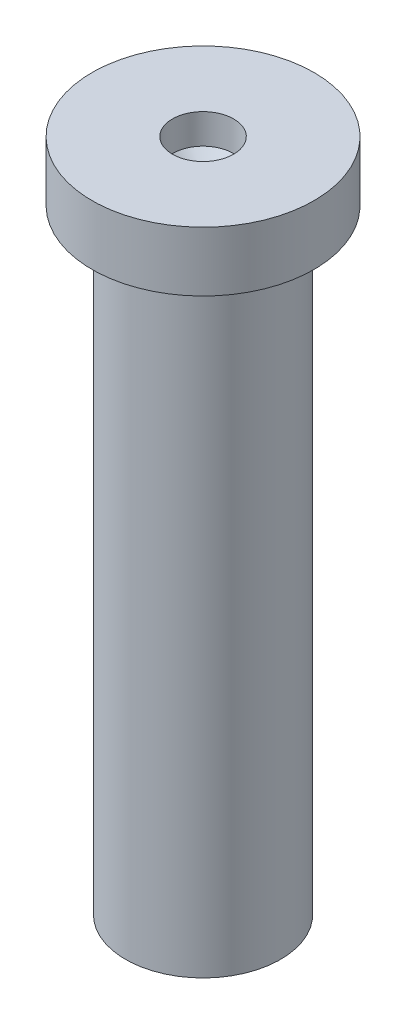
ISO-10303-21;
HEADER;
FILE_DESCRIPTION(('STEP AP214'),'2;1');
FILE_NAME('part.step','',(''),(''),'','','');
FILE_SCHEMA(('AUTOMOTIVE_DESIGN { 1 0 10303 214 1 1 1 1 }'));
ENDSEC;
DATA;
#1=APPLICATION_CONTEXT('core data for automotive mechanical design processes');
#2=APPLICATION_PROTOCOL_DEFINITION('international standard','automotive_design',2000,#1);
#3=PRODUCT_CONTEXT('',#1,'mechanical');
#4=PRODUCT('Part','Part','',(#3));
#5=PRODUCT_RELATED_PRODUCT_CATEGORY('part','',(#4));
#6=PRODUCT_DEFINITION_FORMATION('','',#4);
#7=PRODUCT_DEFINITION_CONTEXT('part definition',#1,'design');
#8=PRODUCT_DEFINITION('design','',#6,#7);
#9=PRODUCT_DEFINITION_SHAPE('','',#8);
#10=(LENGTH_UNIT() NAMED_UNIT(*) SI_UNIT(.MILLI.,.METRE.));
#11=(NAMED_UNIT(*) PLANE_ANGLE_UNIT() SI_UNIT($,.RADIAN.));
#12=(NAMED_UNIT(*) SI_UNIT($,.STERADIAN.) SOLID_ANGLE_UNIT());
#13=UNCERTAINTY_MEASURE_WITH_UNIT(LENGTH_MEASURE(1.E-05),#10,'distance_accuracy_value','');
#14=(GEOMETRIC_REPRESENTATION_CONTEXT(3) GLOBAL_UNCERTAINTY_ASSIGNED_CONTEXT((#13)) GLOBAL_UNIT_ASSIGNED_CONTEXT((#10,
#11,#12)) REPRESENTATION_CONTEXT('',''));
#15=CARTESIAN_POINT('',(0.,0.,0.));
#16=DIRECTION('',(0.,0.,1.));
#17=DIRECTION('',(1.,0.,0.));
#18=AXIS2_PLACEMENT_3D('',#15,#16,#17);
#19=CARTESIAN_POINT('',(-0.930723952188512,-5.32863945841748,0.));
#20=DIRECTION('',(0.,-1.,0.));
#21=DIRECTION('',(0.,0.,-1.));
#22=AXIS2_PLACEMENT_3D('',#19,#20,#21);
#23=PLANE('',#22);
#24=CARTESIAN_POINT('',(-0.930723952188512,-5.32863945841748,0.));
#25=DIRECTION('',(0.,-1.,0.));
#26=DIRECTION('',(0.,0.,-1.));
#27=AXIS2_PLACEMENT_3D('',#24,#25,#26);
#28=CIRCLE('',#27,1.3);
#29=CARTESIAN_POINT('',(-0.930723952188512,-5.32863945841748,-1.3));
#30=VERTEX_POINT('',#29);
#31=EDGE_CURVE('E11',#30,#30,#28,.T.);
#32=ORIENTED_EDGE('',*,*,#31,.T.);
#33=EDGE_LOOP('',(#32));
#34=FACE_BOUND('',#33,.T.);
#35=ADVANCED_FACE('F41',(#34),#23,.T.);
#36=CARTESIAN_POINT('',(-0.930723952188512,-5.32863945841748,0.));
#37=DIRECTION('',(0.,-1.,0.));
#38=DIRECTION('',(0.,0.,-1.));
#39=AXIS2_PLACEMENT_3D('',#36,#37,#38);
#40=CYLINDRICAL_SURFACE('',#39,1.3);
#41=CARTESIAN_POINT('',(-0.930723952188512,4.97136054158252,0.));
#42=DIRECTION('',(0.,-1.,0.));
#43=DIRECTION('',(0.,0.,-1.));
#44=AXIS2_PLACEMENT_3D('',#41,#42,#43);
#45=CIRCLE('',#44,1.3);
#46=CARTESIAN_POINT('',(-0.930723952188512,4.97136054158252,-1.3));
#47=VERTEX_POINT('',#46);
#48=EDGE_CURVE('E48',#47,#47,#45,.T.);
#49=ORIENTED_EDGE('',*,*,#48,.T.);
#50=EDGE_LOOP('',(#49));
#51=FACE_BOUND('',#50,.T.);
#52=ORIENTED_EDGE('',*,*,#31,.F.);
#53=EDGE_LOOP('',(#52));
#54=FACE_BOUND('',#53,.T.);
#55=ADVANCED_FACE('F78',(#51,#54),#40,.T.);
#56=CARTESIAN_POINT('',(0.369276047811488,4.97136054158252,0.));
#57=DIRECTION('',(0.,-1.,0.));
#58=DIRECTION('',(0.,0.,-1.));
#59=AXIS2_PLACEMENT_3D('',#56,#57,#58);
#60=PLANE('',#59);
#61=CARTESIAN_POINT('',(-0.930723952188512,4.97136054158252,0.));
#62=DIRECTION('',(0.,-1.,0.));
#63=DIRECTION('',(0.,0.,-1.));
#64=AXIS2_PLACEMENT_3D('',#61,#62,#63);
#65=CIRCLE('',#64,1.86144790437702);
#66=CARTESIAN_POINT('',(-0.930723952188512,4.97136054158252,-1.86144790437702));
#67=VERTEX_POINT('',#66);
#68=EDGE_CURVE('E71',#67,#67,#65,.T.);
#69=ORIENTED_EDGE('',*,*,#68,.T.);
#70=EDGE_LOOP('',(#69));
#71=FACE_BOUND('',#70,.T.);
#72=ORIENTED_EDGE('',*,*,#48,.F.);
#73=EDGE_LOOP('',(#72));
#74=FACE_BOUND('',#73,.T.);
#75=ADVANCED_FACE('F81',(#71,#74),#60,.T.);
#76=CARTESIAN_POINT('',(-0.930723952188512,-5.32863945841748,0.));
#77=DIRECTION('',(0.,-1.,0.));
#78=DIRECTION('',(0.,0.,-1.));
#79=AXIS2_PLACEMENT_3D('',#76,#77,#78);
#80=CYLINDRICAL_SURFACE('',#79,1.86144790437702);
#81=CARTESIAN_POINT('',(-0.930723952188512,5.97136054158252,0.));
#82=DIRECTION('',(0.,-1.,0.));
#83=DIRECTION('',(0.,0.,-1.));
#84=AXIS2_PLACEMENT_3D('',#81,#82,#83);
#85=CIRCLE('',#84,1.86144790437702);
#86=CARTESIAN_POINT('',(-0.930723952188512,5.97136054158252,-1.86144790437702));
#87=VERTEX_POINT('',#86);
#88=EDGE_CURVE('E65',#87,#87,#85,.T.);
#89=ORIENTED_EDGE('',*,*,#88,.T.);
#90=EDGE_LOOP('',(#89));
#91=FACE_BOUND('',#90,.T.);
#92=ORIENTED_EDGE('',*,*,#68,.F.);
#93=EDGE_LOOP('',(#92));
#94=FACE_BOUND('',#93,.T.);
#95=ADVANCED_FACE('F83',(#91,#94),#80,.T.);
#96=CARTESIAN_POINT('',(0.930723952188512,5.97136054158252,0.));
#97=DIRECTION('',(0.,1.,0.));
#98=DIRECTION('',(0.,0.,1.));
#99=AXIS2_PLACEMENT_3D('',#96,#97,#98);
#100=PLANE('',#99);
#101=CARTESIAN_POINT('',(-0.930723952188512,5.97136054158252,0.));
#102=DIRECTION('',(0.,-1.,0.));
#103=DIRECTION('',(0.,0.,-1.));
#104=AXIS2_PLACEMENT_3D('',#101,#102,#103);
#105=CIRCLE('',#104,0.51316806995542);
#106=CARTESIAN_POINT('',(-0.930723952188512,5.97136054158252,-0.51316806995542));
#107=VERTEX_POINT('',#106);
#108=EDGE_CURVE('E61',#107,#107,#105,.T.);
#109=ORIENTED_EDGE('',*,*,#108,.T.);
#110=EDGE_LOOP('',(#109));
#111=FACE_BOUND('',#110,.T.);
#112=ORIENTED_EDGE('',*,*,#88,.F.);
#113=EDGE_LOOP('',(#112));
#114=FACE_BOUND('',#113,.T.);
#115=ADVANCED_FACE('F90',(#111,#114),#100,.T.);
#116=CARTESIAN_POINT('',(-0.930723952188512,-5.32863945841748,0.));
#117=DIRECTION('',(0.,-1.,0.));
#118=DIRECTION('',(0.,0.,-1.));
#119=AXIS2_PLACEMENT_3D('',#116,#117,#118);
#120=CYLINDRICAL_SURFACE('',#119,0.51316806995542);
#121=CARTESIAN_POINT('',(-0.930723952188512,5.4688453154123,0.));
#122=DIRECTION('',(0.,-1.,0.));
#123=DIRECTION('',(0.,0.,-1.));
#124=AXIS2_PLACEMENT_3D('',#121,#122,#123);
#125=CIRCLE('',#124,0.51316806995542);
#126=CARTESIAN_POINT('',(-0.930723952188512,5.4688453154123,-0.51316806995542));
#127=VERTEX_POINT('',#126);
#128=EDGE_CURVE('E58',#127,#127,#125,.T.);
#129=ORIENTED_EDGE('',*,*,#128,.T.);
#130=EDGE_LOOP('',(#129));
#131=FACE_BOUND('',#130,.T.);
#132=ORIENTED_EDGE('',*,*,#108,.F.);
#133=EDGE_LOOP('',(#132));
#134=FACE_BOUND('',#133,.T.);
#135=ADVANCED_FACE('F54',(#131,#134),#120,.F.);
#136=CARTESIAN_POINT('',(-0.930723952188512,5.4688453154123,0.));
#137=DIRECTION('',(0.,1.,0.));
#138=DIRECTION('',(0.,0.,1.));
#139=AXIS2_PLACEMENT_3D('',#136,#137,#138);
#140=CONICAL_SURFACE('',#139,0.51316806995542,0.851539186324674);
#141=CARTESIAN_POINT('',(-0.930723952188512,5.01943609322592,0.));
#142=VERTEX_POINT('',#141);
#143=VERTEX_LOOP('',#142);
#144=FACE_BOUND('',#143,.T.);
#145=ORIENTED_EDGE('',*,*,#128,.F.);
#146=EDGE_LOOP('',(#145));
#147=FACE_BOUND('',#146,.T.);
#148=ADVANCED_FACE('F51',(#144,#147),#140,.F.);
#149=CLOSED_SHELL('',(#35,#55,#75,#95,#115,#135,#148));
#150=MANIFOLD_SOLID_BREP('B2',#149);
#151=ADVANCED_BREP_SHAPE_REPRESENTATION('',(#18,#150),#14);
#152=SHAPE_DEFINITION_REPRESENTATION(#9,#151);
ENDSEC;
END-ISO-10303-21;
